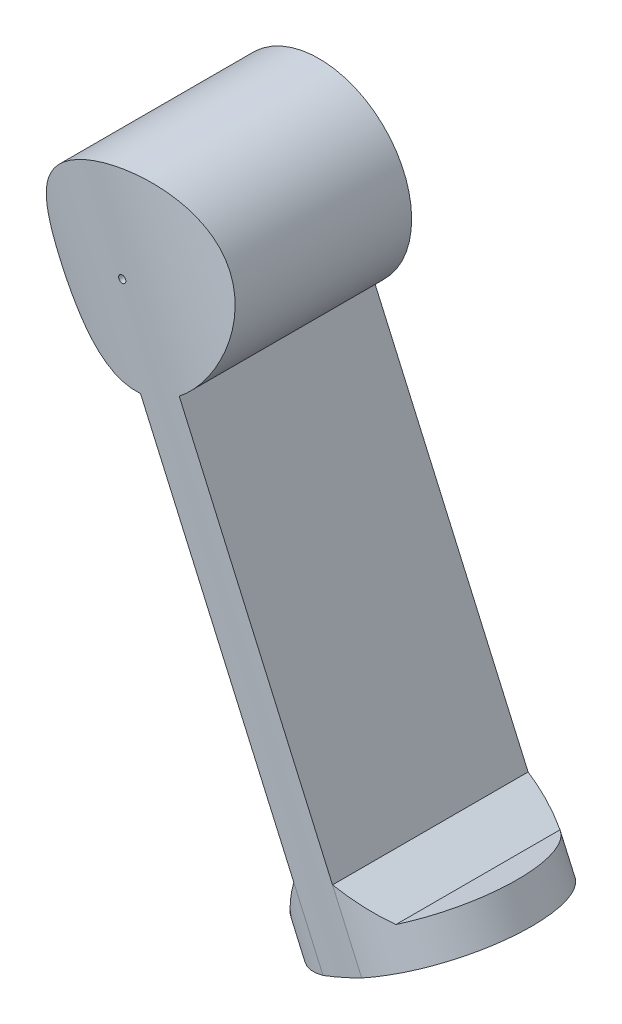
ISO-10303-21;
HEADER;
FILE_DESCRIPTION(('STEP AP214'),'2;1');
FILE_NAME('part.step','',(''),(''),'','','');
FILE_SCHEMA(('AUTOMOTIVE_DESIGN { 1 0 10303 214 1 1 1 1 }'));
ENDSEC;
DATA;
#1=APPLICATION_CONTEXT('core data for automotive mechanical design processes');
#2=APPLICATION_PROTOCOL_DEFINITION('international standard','automotive_design',2000,#1);
#3=PRODUCT_CONTEXT('',#1,'mechanical');
#4=PRODUCT('Part','Part','',(#3));
#5=PRODUCT_RELATED_PRODUCT_CATEGORY('part','',(#4));
#6=PRODUCT_DEFINITION_FORMATION('','',#4);
#7=PRODUCT_DEFINITION_CONTEXT('part definition',#1,'design');
#8=PRODUCT_DEFINITION('design','',#6,#7);
#9=PRODUCT_DEFINITION_SHAPE('','',#8);
#10=(LENGTH_UNIT() NAMED_UNIT(*) SI_UNIT(.MILLI.,.METRE.));
#11=(NAMED_UNIT(*) PLANE_ANGLE_UNIT() SI_UNIT($,.RADIAN.));
#12=(NAMED_UNIT(*) SI_UNIT($,.STERADIAN.) SOLID_ANGLE_UNIT());
#13=UNCERTAINTY_MEASURE_WITH_UNIT(LENGTH_MEASURE(1.E-05),#10,'distance_accuracy_value','');
#14=(GEOMETRIC_REPRESENTATION_CONTEXT(3) GLOBAL_UNCERTAINTY_ASSIGNED_CONTEXT((#13)) GLOBAL_UNIT_ASSIGNED_CONTEXT((#10,
#11,#12)) REPRESENTATION_CONTEXT('',''));
#15=CARTESIAN_POINT('',(0.,0.,0.));
#16=DIRECTION('',(0.,0.,1.));
#17=DIRECTION('',(1.,0.,0.));
#18=AXIS2_PLACEMENT_3D('',#15,#16,#17);
#19=CARTESIAN_POINT('',(55.304632903635,-224.555628784848,54.1865984850081));
#20=DIRECTION('',(0.914562167261489,0.40444535133188,0.));
#21=DIRECTION('',(-0.40444535133188,0.914562167261489,0.));
#22=AXIS2_PLACEMENT_3D('',#19,#20,#21);
#23=PLANE('',#22);
#24=DIRECTION('',(-0.40444535133188,0.914562167261489,0.));
#25=VECTOR('',#24,1.);
#26=CARTESIAN_POINT('',(55.304632903635,-224.555628784848,0.));
#27=LINE('',#26,#25);
#28=CARTESIAN_POINT('',(47.2157258769974,-206.264385439618,0.));
#29=VERTEX_POINT('',#28);
#30=CARTESIAN_POINT('',(4.74896398715,-110.235357877162,0.));
#31=VERTEX_POINT('',#30);
#32=EDGE_CURVE('E236',#29,#31,#27,.T.);
#33=ORIENTED_EDGE('',*,*,#32,.F.);
#34=DIRECTION('',(0.,0.,1.));
#35=VECTOR('',#34,1.);
#36=CARTESIAN_POINT('',(47.2157258769974,-206.264385439618,54.1865984850081));
#37=LINE('',#36,#35);
#38=CARTESIAN_POINT('',(47.2157258769974,-206.264385439618,54.1865984850081));
#39=VERTEX_POINT('',#38);
#40=EDGE_CURVE('E265',#29,#39,#37,.T.);
#41=ORIENTED_EDGE('',*,*,#40,.T.);
#42=DIRECTION('',(-0.40444535133188,0.914562167261489,0.));
#43=VECTOR('',#42,1.);
#44=CARTESIAN_POINT('',(55.304632903635,-224.555628784848,54.1865984850081));
#45=LINE('',#44,#43);
#46=CARTESIAN_POINT('',(4.74896398715,-110.235357877162,54.1865984850081));
#47=VERTEX_POINT('',#46);
#48=EDGE_CURVE('E126',#39,#47,#45,.T.);
#49=ORIENTED_EDGE('',*,*,#48,.T.);
#50=DIRECTION('',(0.,0.,-1.));
#51=VECTOR('',#50,1.);
#52=CARTESIAN_POINT('',(4.74896398715,-110.235357877162,54.5010000000006));
#53=LINE('',#52,#51);
#54=EDGE_CURVE('E253',#47,#31,#53,.T.);
#55=ORIENTED_EDGE('',*,*,#54,.T.);
#56=EDGE_LOOP('',(#33,#41,#49,#55));
#57=FACE_BOUND('',#56,.T.);
#58=ADVANCED_FACE('F41',(#57),#23,.F.);
#59=CARTESIAN_POINT('',(66.0289724959302,-219.813021393602,0.));
#60=DIRECTION('',(-0.914562167261489,-0.40444535133188,0.));
#61=DIRECTION('',(0.40444535133188,-0.914562167261489,0.));
#62=AXIS2_PLACEMENT_3D('',#59,#60,#61);
#63=PLANE('',#62);
#64=DIRECTION('',(-0.40444535133188,0.914562167261489,0.));
#65=VECTOR('',#64,1.);
#66=CARTESIAN_POINT('',(66.0289724959302,-219.813021393602,54.186598485008));
#67=LINE('',#66,#65);
#68=CARTESIAN_POINT('',(57.9400654692926,-201.521778048372,54.186598485008));
#69=VERTEX_POINT('',#68);
#70=CARTESIAN_POINT('',(15.4733035794452,-105.492750485916,54.186598485008));
#71=VERTEX_POINT('',#70);
#72=EDGE_CURVE('E230',#69,#71,#67,.T.);
#73=ORIENTED_EDGE('',*,*,#72,.F.);
#74=DIRECTION('',(0.,0.,-1.));
#75=VECTOR('',#74,1.);
#76=CARTESIAN_POINT('',(57.9400654692926,-201.521778048372,0.));
#77=LINE('',#76,#75);
#78=CARTESIAN_POINT('',(57.9400654692926,-201.521778048372,0.));
#79=VERTEX_POINT('',#78);
#80=EDGE_CURVE('E247',#69,#79,#77,.T.);
#81=ORIENTED_EDGE('',*,*,#80,.T.);
#82=DIRECTION('',(-0.40444535133188,0.914562167261489,0.));
#83=VECTOR('',#82,1.);
#84=CARTESIAN_POINT('',(66.0289724959302,-219.813021393602,0.));
#85=LINE('',#84,#83);
#86=CARTESIAN_POINT('',(15.4733035794452,-105.492750485916,0.));
#87=VERTEX_POINT('',#86);
#88=EDGE_CURVE('E232',#79,#87,#85,.T.);
#89=ORIENTED_EDGE('',*,*,#88,.T.);
#90=DIRECTION('',(0.,0.,-1.));
#91=VECTOR('',#90,1.);
#92=CARTESIAN_POINT('',(15.4733035794452,-105.492750485916,54.5010000000006));
#93=LINE('',#92,#91);
#94=EDGE_CURVE('E244',#71,#87,#93,.T.);
#95=ORIENTED_EDGE('',*,*,#94,.F.);
#96=EDGE_LOOP('',(#73,#81,#89,#95));
#97=FACE_BOUND('',#96,.T.);
#98=ADVANCED_FACE('F169',(#97),#63,.F.);
#99=CARTESIAN_POINT('',(0.,-85.,54.5010000000006));
#100=DIRECTION('',(0.,0.,-1.));
#101=DIRECTION('',(-1.,0.,0.));
#102=AXIS2_PLACEMENT_3D('',#99,#100,#101);
#103=CYLINDRICAL_SURFACE('',#102,25.6783166531544);
#104=ORIENTED_EDGE('',*,*,#54,.F.);
#105=CARTESIAN_POINT('',(4.74896398715001,-110.235357877162,54.1865984850081));
#106=CARTESIAN_POINT('',(4.39578173439005,-110.301823151769,54.1490899203728));
#107=CARTESIAN_POINT('',(4.04158383911201,-110.360799290803,54.1084011387251));
#108=CARTESIAN_POINT('',(3.33178426797788,-110.463773774932,54.020965873823));
#109=CARTESIAN_POINT('',(2.97618268605514,-110.507773105631,53.9742197894713));
#110=CARTESIAN_POINT('',(1.90870765732477,-110.61726038661,53.8254201912133));
#111=CARTESIAN_POINT('',(1.19560242375043,-110.660342901958,53.714744944893));
#112=CARTESIAN_POINT('',(-0.225566025707288,-110.687128495577,53.4738964361607));
#113=CARTESIAN_POINT('',(-0.93363813781695,-110.671049855118,53.3437965450759));
#114=CARTESIAN_POINT('',(-2.3429304154645,-110.580953843067,53.0671527324364));
#115=CARTESIAN_POINT('',(-3.04414968527553,-110.506928997293,52.9206066916671));
#116=CARTESIAN_POINT('',(-4.43403271839796,-110.302327779412,52.6150773286723));
#117=CARTESIAN_POINT('',(-5.12271836769118,-110.171862364575,52.456118908012));
#118=CARTESIAN_POINT('',(-6.48511084718551,-109.855750865252,52.1294260192904));
#119=CARTESIAN_POINT('',(-7.15881812306708,-109.670106424982,51.9616918128513));
#120=CARTESIAN_POINT('',(-8.48867717961974,-109.244714189853,51.6212924368115));
#121=CARTESIAN_POINT('',(-9.14480671891683,-109.004901165802,51.4486215432946));
#122=CARTESIAN_POINT('',(-10.1124764556144,-108.605837548371,51.1893136904957));
#123=CARTESIAN_POINT('',(-10.43229512978,-108.46625071921,51.102822984955));
#124=CARTESIAN_POINT('',(-11.0661621038571,-108.174076478821,50.9302476898909));
#125=CARTESIAN_POINT('',(-11.3802087930071,-108.021485503594,50.8441632185691));
#126=CARTESIAN_POINT('',(-12.3480503440152,-107.526559620502,50.5777135143377));
#127=CARTESIAN_POINT('',(-12.9911033562038,-107.16200221239,50.3990120031298));
#128=CARTESIAN_POINT('',(-14.2452393572118,-106.377467469278,50.0512869091966));
#129=CARTESIAN_POINT('',(-14.8563235253713,-105.957492180676,49.8822629694411));
#130=CARTESIAN_POINT('',(-15.7456880909242,-105.287608288772,49.6400466414462));
#131=CARTESIAN_POINT('',(-16.0376083117689,-105.057652100287,49.5611921004779));
#132=CARTESIAN_POINT('',(-16.6118007634477,-104.584747821933,49.4079205936118));
#133=CARTESIAN_POINT('',(-16.8940753965172,-104.341803006115,49.3335025193222));
#134=CARTESIAN_POINT('',(-17.7257219224704,-103.593827879944,49.1178577394246));
#135=CARTESIAN_POINT('',(-18.2600225846682,-103.069577032655,48.9842112057091));
#136=CARTESIAN_POINT('',(-19.2681217742951,-101.989553760178,48.7458332513059));
#137=CARTESIAN_POINT('',(-19.7432454166337,-101.435178879621,48.6403613025526));
#138=CARTESIAN_POINT('',(-20.6465273326701,-100.285004629084,48.4572549153725));
#139=CARTESIAN_POINT('',(-21.0746864776025,-99.6892060278869,48.3796199604831));
#140=CARTESIAN_POINT('',(-21.8793662443768,-98.4613381885927,48.255419492238));
#141=CARTESIAN_POINT('',(-22.2559304314486,-97.829300197695,48.2088276369896));
#142=CARTESIAN_POINT('',(-22.9539435822682,-96.5340139499445,48.1486115329208));
#143=CARTESIAN_POINT('',(-23.2753982925211,-95.8707689563847,48.1349838448379));
#144=CARTESIAN_POINT('',(-23.8284672296942,-94.5922686664522,48.1409280528063));
#145=CARTESIAN_POINT('',(-24.0660333434858,-93.9795598714024,48.1570754763182));
#146=CARTESIAN_POINT('',(-24.4931767525723,-92.7388999684583,48.2154779269083));
#147=CARTESIAN_POINT('',(-24.6827579178532,-92.1109500942364,48.2577308476319));
#148=CARTESIAN_POINT('',(-25.0129553117176,-90.8443527269605,48.3669147451412));
#149=CARTESIAN_POINT('',(-25.1535645092675,-90.2057037115874,48.4338492626905));
#150=CARTESIAN_POINT('',(-25.3853757515799,-88.9222370130245,48.5902130667698));
#151=CARTESIAN_POINT('',(-25.4765761466251,-88.2774191245929,48.6796431042597));
#152=CARTESIAN_POINT('',(-25.6092275166748,-86.9898823697911,48.8776144183032));
#153=CARTESIAN_POINT('',(-25.6509906358644,-86.3471761643727,48.986030768782));
#154=CARTESIAN_POINT('',(-25.6862654326647,-85.063470464654,49.2192794498823));
#155=CARTESIAN_POINT('',(-25.6797779188332,-84.4224709419342,49.3441115053839));
#156=CARTESIAN_POINT('',(-25.6192321022652,-83.14537868749,49.606921237428));
#157=CARTESIAN_POINT('',(-25.5651678014694,-82.5092865846498,49.7449005695067));
#158=CARTESIAN_POINT('',(-25.4102470967629,-81.2448459338262,50.030655249246));
#159=CARTESIAN_POINT('',(-25.3093737929778,-80.6165002667889,50.1784341183916));
#160=CARTESIAN_POINT('',(-25.048741063299,-79.3053824385909,50.4961282951682));
#161=CARTESIAN_POINT('',(-24.8839318504555,-78.6237798244404,50.6667435988213));
#162=CARTESIAN_POINT('',(-24.4994375419398,-77.2770495608926,51.0112237231812));
#163=CARTESIAN_POINT('',(-24.2797485662502,-76.6119230800194,51.1850887728417));
#164=CARTESIAN_POINT('',(-23.7865213356231,-75.3011346013338,51.5317712458763));
#165=CARTESIAN_POINT('',(-23.512948716837,-74.6554853295456,51.7045879277847));
#166=CARTESIAN_POINT('',(-22.9133945512714,-73.3877745809034,52.0447262208092));
#167=CARTESIAN_POINT('',(-22.5874309265868,-72.7657051273969,52.2120496875752));
#168=CARTESIAN_POINT('',(-21.8634299579862,-71.5121935374794,52.5468520524263));
#169=CARTESIAN_POINT('',(-21.4622550713892,-70.8824021361556,52.7137459593525));
#170=CARTESIAN_POINT('',(-20.6044712892669,-69.6575517359962,53.0321711346233));
#171=CARTESIAN_POINT('',(-20.147859560933,-69.0624945143712,53.1837016171743));
#172=CARTESIAN_POINT('',(-19.1818996008161,-67.9121541760709,53.4669933756228));
#173=CARTESIAN_POINT('',(-18.6725737802747,-67.3568543251595,53.5987629949153));
#174=CARTESIAN_POINT('',(-17.604223784886,-66.2907352595789,53.8386885970215));
#175=CARTESIAN_POINT('',(-17.0452040024153,-65.7799121215629,53.946846663911));
#176=CARTESIAN_POINT('',(-15.9166162822323,-64.837042320187,54.1305070113692));
#177=CARTESIAN_POINT('',(-15.3497218347709,-64.4021017816966,54.2075863674115));
#178=CARTESIAN_POINT('',(-14.179630705149,-63.5797935116597,54.3357923256212));
#179=CARTESIAN_POINT('',(-13.5764353316619,-63.1924240666713,54.3869198627435));
#180=CARTESIAN_POINT('',(-12.338742493948,-62.4690222472698,54.4617223035217));
#181=CARTESIAN_POINT('',(-11.7042592840308,-62.1329667756123,54.4854095902877));
#182=CARTESIAN_POINT('',(-10.4090353448979,-61.5150539222967,54.5046720403544));
#183=CARTESIAN_POINT('',(-9.74829606048685,-61.23319356339,54.5002487483853));
#184=CARTESIAN_POINT('',(-8.45866910541556,-60.7458389372598,54.4648714915411));
#185=CARTESIAN_POINT('',(-7.83132131097304,-60.5361009704125,54.4360154974986));
#186=CARTESIAN_POINT('',(-6.56373073325066,-60.1659653892395,54.3552611950881));
#187=CARTESIAN_POINT('',(-5.92348875539764,-60.0055647032146,54.3033643217184));
#188=CARTESIAN_POINT('',(-4.63462599515305,-59.7348093778529,54.1777987571927));
#189=CARTESIAN_POINT('',(-3.98600502355651,-59.6244558706637,54.1041295735745));
#190=CARTESIAN_POINT('',(-2.68476446427868,-59.4539905493317,53.9367781225654));
#191=CARTESIAN_POINT('',(-2.03214474949216,-59.3938803406705,53.8430952157732));
#192=CARTESIAN_POINT('',(-0.719636682442021,-59.3232615184794,53.6367180940995));
#193=CARTESIAN_POINT('',(-0.0597499458452307,-59.3133239141854,53.5238200740665));
#194=CARTESIAN_POINT('',(1.25593298293786,-59.3439752345688,53.2823531466499));
#195=CARTESIAN_POINT('',(1.91172918242726,-59.3845640690121,53.1537842672528));
#196=CARTESIAN_POINT('',(3.21582905910001,-59.5154170356868,52.8837839848659));
#197=CARTESIAN_POINT('',(3.86413070992379,-59.6056942960098,52.7423491908423));
#198=CARTESIAN_POINT('',(5.1498286569739,-59.8349117094364,52.4496925798431));
#199=CARTESIAN_POINT('',(5.7872243896949,-59.9738543691495,52.2984702590683));
#200=CARTESIAN_POINT('',(7.10121398171629,-60.3130191849804,51.97643334677));
#201=CARTESIAN_POINT('',(7.77659150168804,-60.5174148618241,51.8050410182543));
#202=CARTESIAN_POINT('',(9.107480387865,-60.9807099064552,51.4587794289657));
#203=CARTESIAN_POINT('',(9.76299072834839,-61.2396120828914,51.2839099894423));
#204=CARTESIAN_POINT('',(11.0509720376729,-61.8105983693308,50.9350494912213));
#205=CARTESIAN_POINT('',(11.683434806523,-62.1227011873937,50.7610587637606));
#206=CARTESIAN_POINT('',(12.921989349053,-62.7987353171418,50.418485801765));
#207=CARTESIAN_POINT('',(13.528068137562,-63.1626917809549,50.2499062408803));
#208=CARTESIAN_POINT('',(14.7415996403364,-63.9615448361664,49.9141634244423));
#209=CARTESIAN_POINT('',(15.3474017199209,-64.3991896233782,49.7475552060454));
#210=CARTESIAN_POINT('',(16.5208901707679,-65.3277951340597,49.431148791468));
#211=CARTESIAN_POINT('',(17.0885963421064,-65.8187278087308,49.2813418353417));
#212=CARTESIAN_POINT('',(18.1814092829781,-66.8512509226799,49.0038284855232));
#213=CARTESIAN_POINT('',(18.7065336694338,-67.3928202108647,48.8761129271477));
#214=CARTESIAN_POINT('',(19.7095467515141,-68.5233339132369,48.6476742779805));
#215=CARTESIAN_POINT('',(20.187440789964,-69.1122729551262,48.5469481318621));
#216=CARTESIAN_POINT('',(21.059027276851,-70.2897605375222,48.3827418734715));
#217=CARTESIAN_POINT('',(21.4562884862453,-70.8753704455234,48.3171257380835));
#218=CARTESIAN_POINT('',(22.2020823003157,-72.0792890161707,48.2153471131655));
#219=CARTESIAN_POINT('',(22.5506172846372,-72.6975960799499,48.1791831848599));
#220=CARTESIAN_POINT('',(23.1954729864237,-73.9614739991091,48.1377726193302));
#221=CARTESIAN_POINT('',(23.4918196071001,-74.6070311307958,48.1325106020371));
#222=CARTESIAN_POINT('',(24.0298442335846,-75.9200325118059,48.1530808525528));
#223=CARTESIAN_POINT('',(24.2715252278467,-76.5874755623873,48.1789114201076));
#224=CARTESIAN_POINT('',(24.6786815954424,-77.8759456524695,48.2568294020951));
#225=CARTESIAN_POINT('',(24.8491318745546,-78.4955705606226,48.306273175407));
#226=CARTESIAN_POINT('',(25.1427395529145,-79.7436226752341,48.4282878336723));
#227=CARTESIAN_POINT('',(25.2659004328388,-80.3720492303281,48.5008570157894));
#228=CARTESIAN_POINT('',(25.464720865434,-81.6337123893719,48.6669014788506));
#229=CARTESIAN_POINT('',(25.5403719843898,-82.2669498271465,48.7603804676158));
#230=CARTESIAN_POINT('',(25.6443400634858,-83.5343554779999,48.9655267859813));
#231=CARTESIAN_POINT('',(25.6726544913474,-84.1685237390568,49.0771950882691));
#232=CARTESIAN_POINT('',(25.6826436614739,-85.4602515879519,49.3205789848215));
#233=CARTESIAN_POINT('',(25.6623623061366,-86.1177063570751,49.4529279741707));
#234=CARTESIAN_POINT('',(25.5718171234662,-87.4266755157081,49.7305076944017));
#235=CARTESIAN_POINT('',(25.5015319389293,-88.07818724641,49.8757439063546));
#236=CARTESIAN_POINT('',(25.3118204242347,-89.3721151782812,50.1754254675904));
#237=CARTESIAN_POINT('',(25.1923759598794,-90.0145279324052,50.3298741972506));
#238=CARTESIAN_POINT('',(24.9052920786795,-91.2871286574893,50.6442588641745));
#239=CARTESIAN_POINT('',(24.7376486735798,-91.9173156122091,50.8041952545537));
#240=CARTESIAN_POINT('',(24.3343447077376,-93.2302316994999,51.1433874967513));
#241=CARTESIAN_POINT('',(24.0932852621453,-93.9112626733854,51.3228603022239));
#242=CARTESIAN_POINT('',(23.6892237997042,-94.9159979819611,51.5901465268569));
#243=CARTESIAN_POINT('',(23.5474457119766,-95.2481321550759,51.6789280196293));
#244=CARTESIAN_POINT('',(23.2498335400961,-95.9064994695547,51.8553158233423));
#245=CARTESIAN_POINT('',(23.0939949307192,-96.2327306702653,51.9429217454428));
#246=CARTESIAN_POINT('',(22.606045015023,-97.2010106725135,52.2028863319794));
#247=CARTESIAN_POINT('',(22.2531731176777,-97.8334579900168,52.3726100388785));
#248=CARTESIAN_POINT('',(21.4938118985484,-99.0683093599409,52.7004726567814));
#249=CARTESIAN_POINT('',(21.0873298537401,-99.6707174745799,52.8586131355551));
#250=CARTESIAN_POINT('',(20.2921872831349,-100.747254624301,53.1349882264039));
#251=CARTESIAN_POINT('',(19.9111651198333,-101.226438277303,53.2555513212084));
#252=CARTESIAN_POINT('',(19.1141907776784,-102.158069831212,53.4832647890821));
#253=CARTESIAN_POINT('',(18.6982455117091,-102.610522993245,53.590417806211));
#254=CARTESIAN_POINT('',(17.8323011952579,-103.486886089498,53.7893907243816));
#255=CARTESIAN_POINT('',(17.3822459419138,-103.91074664082,53.8811844833542));
#256=CARTESIAN_POINT('',(16.6837036233137,-104.522446719003,54.0058021556141));
#257=CARTESIAN_POINT('',(16.4468672895999,-104.722391321234,54.0451729826203));
#258=CARTESIAN_POINT('',(15.9656641469493,-105.113918628766,54.1193544634347));
#259=CARTESIAN_POINT('',(15.721296878479,-105.305500822067,54.1541648382833));
#260=CARTESIAN_POINT('',(15.4733035794452,-105.492750485916,54.186598485008));
#261=B_SPLINE_CURVE_WITH_KNOTS('',3,(#105,#106,#107,#108,#109,#110,#111,#112,#113,#114,#115,
#116,#117,#118,#119,#120,#121,#122,#123,#124,#125,#126,#127,#128,#129,#130,#131,#132,#133,#134,
#135,#136,#137,#138,#139,#140,#141,#142,#143,#144,#145,#146,#147,#148,#149,#150,#151,#152,#153,
#154,#155,#156,#157,#158,#159,#160,#161,#162,#163,#164,#165,#166,#167,#168,#169,#170,#171,#172,
#173,#174,#175,#176,#177,#178,#179,#180,#181,#182,#183,#184,#185,#186,#187,#188,#189,#190,#191,
#192,#193,#194,#195,#196,#197,#198,#199,#200,#201,#202,#203,#204,#205,#206,#207,#208,#209,#210,
#211,#212,#213,#214,#215,#216,#217,#218,#219,#220,#221,#222,#223,#224,#225,#226,#227,#228,#229,
#230,#231,#232,#233,#234,#235,#236,#237,#238,#239,#240,#241,#242,#243,#244,#245,#246,#247,#248,
#249,#250,#251,#252,#253,#254,#255,#256,#257,#258,#259,#260),.UNSPECIFIED.,.F.,.F.,(4,2,2,2,2,2,
2,2,2,2,2,2,2,2,2,2,2,2,2,2,2,2,2,2,2,2,2,2,2,2,2,2,2,2,2,2,2,2,2,2,2,2,2,2,2,2,2,2,2,2,2,2,2,2,
2,2,2,2,2,2,2,2,2,2,2,2,2,2,2,2,2,2,2,2,2,2,2,4),(0.,1.08380414968053,2.16753696184339,
4.33328538717988,6.49105108343726,8.6490951445765,10.8029158212141,12.9566723250656,
15.1130363167575,16.1913303903954,17.2699209445759,19.5485331471293,21.8270612316583,
22.9663988072325,24.1054505312447,26.3831473831034,28.593235997772,30.8032836063234,
33.0114534631566,35.2193929242702,37.1890302970783,39.1585087679817,41.1282698856129,
43.0980967678178,45.0554187844598,47.0127080014372,48.97024401143,50.9284873187476,
53.0912504614518,55.2541665555224,57.4184665240178,59.5820276909949,61.8745256387957,
64.1671407820108,66.4587851995925,68.7502272631015,70.9033546453134,73.0564044522375,
75.208482261756,77.3604418114807,79.3444167283428,81.3282680995211,83.3121643463658,
85.2961239844957,87.302612759235,89.3090979506332,91.3161135266133,93.3232324931853,
95.4992894521327,97.6754585679158,99.8523945204557,102.030390035464,104.324543703044,
106.617495614606,108.909493994746,111.201232800315,113.330326543993,115.459316272649,
117.587246300307,119.715059970406,121.64647122243,123.577740288095,125.50935208696,
127.441067214183,129.451835647973,131.463463419804,133.475833920139,135.488370983426,
137.718795870128,138.834175514731,139.949915421282,142.17869732166,144.407177000677,
146.277439490672,148.14733263881,150.020376740011,150.957494527111,151.894669610285),.UNSPECIFIED.);
#262=EDGE_CURVE('E148',#47,#71,#261,.T.);
#263=ORIENTED_EDGE('',*,*,#262,.T.);
#264=ORIENTED_EDGE('',*,*,#94,.T.);
#265=CARTESIAN_POINT('',(0.,-85.,0.));
#266=DIRECTION('',(0.,0.,1.));
#267=DIRECTION('',(1.,0.,0.));
#268=AXIS2_PLACEMENT_3D('',#265,#266,#267);
#269=CIRCLE('',#268,25.6783166531544);
#270=EDGE_CURVE('E147',#87,#31,#269,.T.);
#271=ORIENTED_EDGE('',*,*,#270,.T.);
#272=EDGE_LOOP('',(#104,#263,#264,#271));
#273=FACE_BOUND('',#272,.T.);
#274=ADVANCED_FACE('F165',(#273),#103,.T.);
#275=CARTESIAN_POINT('',(0.,-85.,0.));
#276=DIRECTION('',(0.,0.,1.));
#277=DIRECTION('',(1.,0.,0.));
#278=AXIS2_PLACEMENT_3D('',#275,#276,#277);
#279=PLANE('',#278);
#280=CARTESIAN_POINT('',(55.304632903635,-224.555628784848,0.));
#281=VERTEX_POINT('',#280);
#282=EDGE_CURVE('E108',#281,#29,#27,.T.);
#283=ORIENTED_EDGE('',*,*,#282,.T.);
#284=ORIENTED_EDGE('',*,*,#32,.T.);
#285=ORIENTED_EDGE('',*,*,#270,.F.);
#286=ORIENTED_EDGE('',*,*,#88,.F.);
#287=CARTESIAN_POINT('',(66.0289724959302,-219.813021393602,0.));
#288=VERTEX_POINT('',#287);
#289=EDGE_CURVE('E233',#288,#79,#85,.T.);
#290=ORIENTED_EDGE('',*,*,#289,.F.);
#291=DIRECTION('',(0.914562167261489,0.40444535133188,0.));
#292=VECTOR('',#291,1.);
#293=CARTESIAN_POINT('',(55.304632903635,-224.555628784848,0.));
#294=LINE('',#293,#292);
#295=EDGE_CURVE('E119',#281,#288,#294,.T.);
#296=ORIENTED_EDGE('',*,*,#295,.F.);
#297=EDGE_LOOP('',(#283,#284,#285,#286,#290,#296));
#298=FACE_BOUND('',#297,.T.);
#299=CARTESIAN_POINT('',(0.,-85.,0.));
#300=DIRECTION('',(0.,0.,-1.));
#301=DIRECTION('',(-1.,0.,0.));
#302=AXIS2_PLACEMENT_3D('',#299,#300,#301);
#303=CIRCLE('',#302,1.);
#304=CARTESIAN_POINT('',(-1.,-85.,0.));
#305=VERTEX_POINT('',#304);
#306=EDGE_CURVE('E129',#305,#305,#303,.T.);
#307=ORIENTED_EDGE('',*,*,#306,.F.);
#308=EDGE_LOOP('',(#307));
#309=FACE_BOUND('',#308,.T.);
#310=ADVANCED_FACE('F163',(#298,#309),#279,.F.);
#311=CARTESIAN_POINT('',(-28.3111745932314,-20.9806482916973,-0.499999999999453));
#312=DIRECTION('',(-0.404445351331881,0.914562167261489,0.));
#313=DIRECTION('',(-0.914562167261489,-0.404445351331881,0.));
#314=AXIS2_PLACEMENT_3D('',#311,#312,#313);
#315=CYLINDRICAL_SURFACE('',#314,55.);
#316=CARTESIAN_POINT('',(66.0289724959302,-219.813021393602,54.186598485008));
#317=VERTEX_POINT('',#316);
#318=EDGE_CURVE('E58',#317,#69,#67,.T.);
#319=ORIENTED_EDGE('',*,*,#318,.T.);
#320=ORIENTED_EDGE('',*,*,#72,.T.);
#321=ORIENTED_EDGE('',*,*,#262,.F.);
#322=ORIENTED_EDGE('',*,*,#48,.F.);
#323=CARTESIAN_POINT('',(55.304632903635,-224.555628784848,54.1865984850081));
#324=VERTEX_POINT('',#323);
#325=EDGE_CURVE('E105',#324,#39,#45,.T.);
#326=ORIENTED_EDGE('',*,*,#325,.F.);
#327=CARTESIAN_POINT('',(60.6668026997823,-222.184325089225,-0.499999999999327));
#328=DIRECTION('',(0.40444535133188,-0.914562167261489,0.));
#329=DIRECTION('',(0.914562167261489,0.40444535133188,0.));
#330=AXIS2_PLACEMENT_3D('',#327,#328,#329);
#331=CIRCLE('',#330,55.);
#332=EDGE_CURVE('E116',#317,#324,#331,.T.);
#333=ORIENTED_EDGE('',*,*,#332,.F.);
#334=EDGE_LOOP('',(#319,#320,#321,#322,#326,#333));
#335=FACE_BOUND('',#334,.T.);
#336=CARTESIAN_POINT('',(-1.,-85.,54.4923956201427));
#337=CARTESIAN_POINT('',(-0.999997513539082,-85.056162437725,54.4920179592549));
#338=CARTESIAN_POINT('',(-0.995252814187239,-85.1123658411768,54.4916983792427));
#339=CARTESIAN_POINT('',(-0.976390752173137,-85.2232256662963,54.491212079589));
#340=CARTESIAN_POINT('',(-0.96226215954066,-85.2778801525201,54.4910455436695));
#341=CARTESIAN_POINT('',(-0.925034233466295,-85.3840203891035,54.4908845678804));
#342=CARTESIAN_POINT('',(-0.901939141757089,-85.4355076244552,54.4908900467342));
#343=CARTESIAN_POINT('',(-0.847439733160817,-85.5338599796703,54.4910723276755));
#344=CARTESIAN_POINT('',(-0.816037472643445,-85.5807262394813,54.4912490873926));
#345=CARTESIAN_POINT('',(-0.745810163733773,-85.6685263213466,54.4917539383319));
#346=CARTESIAN_POINT('',(-0.706984578389002,-85.7094597138811,54.4920820405037));
#347=CARTESIAN_POINT('',(-0.623012465653904,-85.7842296322839,54.4928526099204));
#348=CARTESIAN_POINT('',(-0.577865686108959,-85.8180658749097,54.4932950817281));
#349=CARTESIAN_POINT('',(-0.48252853473798,-85.8776829556739,54.4942445557246));
#350=CARTESIAN_POINT('',(-0.432337634895792,-85.9034629493247,54.4947515646706));
#351=CARTESIAN_POINT('',(-0.328340483870593,-85.946231295579,54.4957729234566));
#352=CARTESIAN_POINT('',(-0.274534237300096,-85.9632196593987,54.4962872732872));
#353=CARTESIAN_POINT('',(-0.164827014691301,-85.9879240283609,54.4972653930261));
#354=CARTESIAN_POINT('',(-0.10892581272561,-85.9956390304469,54.497729157458));
#355=CARTESIAN_POINT('',(0.00337904140585012,-86.0015739975159,54.4985537564623));
#356=CARTESIAN_POINT('',(0.0597826923998799,-85.9997939846361,54.4989145912747));
#357=CARTESIAN_POINT('',(0.17148695361988,-85.9867896030462,54.4994926264161));
#358=CARTESIAN_POINT('',(0.226787647631675,-85.9755659545382,54.4997098376959));
#359=CARTESIAN_POINT('',(0.334720239976415,-85.9439936022753,54.4999761801965));
#360=CARTESIAN_POINT('',(0.387352138046728,-85.9236448976223,54.5000253114008));
#361=CARTESIAN_POINT('',(0.488445408828583,-85.874403671507,54.4999499596074));
#362=CARTESIAN_POINT('',(0.536907365213963,-85.8455123482892,54.4998255009496));
#363=CARTESIAN_POINT('',(0.628293413339798,-85.7800051525879,54.499417042184));
#364=CARTESIAN_POINT('',(0.671217506664314,-85.743389282314,54.4991330421219));
#365=CARTESIAN_POINT('',(0.750310404702162,-85.6634719038756,54.4984375044871));
#366=CARTESIAN_POINT('',(0.786479105937865,-85.6201702933189,54.4980259649609));
#367=CARTESIAN_POINT('',(0.851034426328738,-85.5281107836147,54.4971217298239));
#368=CARTESIAN_POINT('',(0.879421036661107,-85.4793528782812,54.496629034121));
#369=CARTESIAN_POINT('',(0.927610544212011,-85.3777567213583,54.495617935607));
#370=CARTESIAN_POINT('',(0.947412183263624,-85.324917873024,54.4950995290402));
#371=CARTESIAN_POINT('',(0.977863768449265,-85.2166654629051,54.4940955149038));
#372=CARTESIAN_POINT('',(0.988513712020953,-85.1612519003997,54.4936099073435));
#373=CARTESIAN_POINT('',(1.00035969337215,-85.049419828428,54.4927262195537));
#374=CARTESIAN_POINT('',(1.001555265735,-84.993001269625,54.4923281436342));
#375=CARTESIAN_POINT('',(0.99445692623826,-84.8807635154225,54.4916644455077));
#376=CARTESIAN_POINT('',(0.986163022140472,-84.8249443195326,54.4913988231924));
#377=CARTESIAN_POINT('',(0.960322520114141,-84.7154971598816,54.4910300184704));
#378=CARTESIAN_POINT('',(0.942777078218019,-84.6618689232494,54.4909268157748));
#379=CARTESIAN_POINT('',(0.898932222518392,-84.5583190150453,54.49089442706));
#380=CARTESIAN_POINT('',(0.872632816005165,-84.5083973403867,54.4909652408959));
#381=CARTESIAN_POINT('',(0.812030033869527,-84.4136828656188,54.4912728812194));
#382=CARTESIAN_POINT('',(0.777727492850325,-84.3688895314285,54.4915096904014));
#383=CARTESIAN_POINT('',(0.702090796782061,-84.285696840846,54.4921226004907));
#384=CARTESIAN_POINT('',(0.66075663500412,-84.2472974905726,54.4924987015312));
#385=CARTESIAN_POINT('',(0.572226371392914,-84.1779793890166,54.493347829782));
#386=CARTESIAN_POINT('',(0.525029803191241,-84.1470612334585,54.4938208647056));
#387=CARTESIAN_POINT('',(0.426116681920355,-84.0935865096413,54.4948105183164));
#388=CARTESIAN_POINT('',(0.37440012933726,-84.0710299404829,54.495327136999));
#389=CARTESIAN_POINT('',(0.267906876057287,-84.0349157543609,54.4963458017138));
#390=CARTESIAN_POINT('',(0.213129752421789,-84.0213593844809,54.4968478457174));
#391=CARTESIAN_POINT('',(0.102076340790563,-84.0036355221581,54.4977806897391));
#392=CARTESIAN_POINT('',(0.0458000503045582,-83.9994680453122,54.4982114896389));
#393=CARTESIAN_POINT('',(-0.0666530869620074,-84.0006406699267,54.4989532689167));
#394=CARTESIAN_POINT('',(-0.122829935724421,-84.0059805797219,54.49926425071));
#395=CARTESIAN_POINT('',(-0.23349042128896,-84.0260164215056,54.4997313438032));
#396=CARTESIAN_POINT('',(-0.28797405641513,-84.0407123627544,54.4998874549499));
#397=CARTESIAN_POINT('',(-0.393693985254047,-84.0790406638364,54.5000271948295));
#398=CARTESIAN_POINT('',(-0.444930694795339,-84.1026718766322,54.5000108456943));
#399=CARTESIAN_POINT('',(-0.542707813335606,-84.158198980013,54.4998075647814));
#400=CARTESIAN_POINT('',(-0.589248407383436,-84.190094544767,54.4996206397282));
#401=CARTESIAN_POINT('',(-0.676307966519438,-84.2612392340956,54.4990973298985));
#402=CARTESIAN_POINT('',(-0.71682783695718,-84.3004872510547,54.4987609676236));
#403=CARTESIAN_POINT('',(-0.790714412858709,-84.3852386660537,54.4979765780498));
#404=CARTESIAN_POINT('',(-0.824079337646922,-84.4307436166639,54.4975285230135));
#405=CARTESIAN_POINT('',(-0.88271360454363,-84.5267316328581,54.4965710501562));
#406=CARTESIAN_POINT('',(-0.907978055703517,-84.5772176819931,54.4960615955174));
#407=CARTESIAN_POINT('',(-0.949644096533317,-84.6816750705715,54.4950394688706));
#408=CARTESIAN_POINT('',(-0.966056271775295,-84.7356421604899,54.4945268014501));
#409=CARTESIAN_POINT('',(-0.98519100777212,-84.824959454517,54.4937374199632));
#410=CARTESIAN_POINT('',(-0.990737409208946,-84.8597298919761,54.4934441270443));
#411=CARTESIAN_POINT('',(-0.998142684334199,-84.9296615291203,54.4928915008384));
#412=CARTESIAN_POINT('',(-1.00000155739162,-84.9648227288722,54.4926321675573));
#413=CARTESIAN_POINT('',(-1.,-85.,54.4923956201427));
#414=B_SPLINE_CURVE_WITH_KNOTS('',3,(#336,#337,#338,#339,#340,#341,#342,#343,#344,#345,#346,
#347,#348,#349,#350,#351,#352,#353,#354,#355,#356,#357,#358,#359,#360,#361,#362,#363,#364,#365,
#366,#367,#368,#369,#370,#371,#372,#373,#374,#375,#376,#377,#378,#379,#380,#381,#382,#383,#384,
#385,#386,#387,#388,#389,#390,#391,#392,#393,#394,#395,#396,#397,#398,#399,#400,#401,#402,#403,
#404,#405,#406,#407,#408,#409,#410,#411,#412,#413),.UNSPECIFIED.,.T.,.F.,(4,2,2,2,2,2,2,2,2,2,2,
2,2,2,2,2,2,2,2,2,2,2,2,2,2,2,2,2,2,2,2,2,2,2,2,2,2,2,4),(0.,0.168362756296444,
0.336927360975247,0.505412320691695,0.673855612338752,0.842311092632374,1.01077329458875,
1.1792531494943,1.34773278945482,1.51623065143809,1.68472812057761,1.8532127407228,
2.02169737744832,2.1901583925987,2.35861935956206,2.52708290676233,2.69554664495421,
2.86403506394074,3.0325235301015,3.20102029050499,3.36951691308869,3.53799248604597,
3.7064679186976,3.87492578981296,4.04338382213424,4.21185526428678,4.3803266883204,
4.54882145118549,4.71731649395586,4.88580813997032,5.05429995275382,5.22277014327014,
5.39123369268051,5.55967188416063,5.72815194689916,5.8967335447273,6.06511310282544,
6.17056688212187,6.27602067946339),.UNSPECIFIED.);
#415=CARTESIAN_POINT('',(-1.,-85.,54.4923956201427));
#416=VERTEX_POINT('',#415);
#417=EDGE_CURVE('E134',#416,#416,#414,.T.);
#418=ORIENTED_EDGE('',*,*,#417,.F.);
#419=EDGE_LOOP('',(#418));
#420=FACE_BOUND('',#419,.T.);
#421=ADVANCED_FACE('F123',(#335,#420),#315,.T.);
#422=CARTESIAN_POINT('',(0.,-85.,54.5020000000006));
#423=DIRECTION('',(0.,0.,-1.));
#424=DIRECTION('',(-1.,0.,0.));
#425=AXIS2_PLACEMENT_3D('',#422,#423,#424);
#426=CYLINDRICAL_SURFACE('',#425,1.);
#427=ORIENTED_EDGE('',*,*,#417,.T.);
#428=EDGE_LOOP('',(#427));
#429=FACE_BOUND('',#428,.T.);
#430=ORIENTED_EDGE('',*,*,#306,.T.);
#431=EDGE_LOOP('',(#430));
#432=FACE_BOUND('',#431,.T.);
#433=ADVANCED_FACE('F156',(#429,#432),#426,.F.);
#434=CARTESIAN_POINT('',(60.6668026997823,-222.184325089225,-0.499999999999327));
#435=DIRECTION('',(0.40444535133188,-0.914562167261489,0.));
#436=DIRECTION('',(0.914562167261489,0.40444535133188,0.));
#437=AXIS2_PLACEMENT_3D('',#434,#435,#436);
#438=PLANE('',#437);
#439=CARTESIAN_POINT('',(60.6668026997826,-222.184325089225,27.093299242504));
#440=DIRECTION('',(0.40444535133188,-0.914562167261489,0.));
#441=DIRECTION('',(0.914562167261489,0.40444535133188,0.));
#442=AXIS2_PLACEMENT_3D('',#439,#440,#441);
#443=CIRCLE('',#442,0.99999999999999);
#444=CARTESIAN_POINT('',(61.5813648670441,-221.779879737893,27.093299242504));
#445=VERTEX_POINT('',#444);
#446=EDGE_CURVE('E214',#445,#445,#443,.T.);
#447=ORIENTED_EDGE('',*,*,#446,.F.);
#448=EDGE_LOOP('',(#447));
#449=FACE_BOUND('',#448,.T.);
#450=ORIENTED_EDGE('',*,*,#332,.T.);
#451=CARTESIAN_POINT('',(60.6668026997826,-222.184325089225,27.093299242504));
#452=DIRECTION('',(0.40444535133188,-0.914562167261489,0.));
#453=DIRECTION('',(0.914562167261489,0.40444535133188,0.));
#454=AXIS2_PLACEMENT_3D('',#451,#452,#453);
#455=CIRCLE('',#454,27.7204402920203);
#456=EDGE_CURVE('E101',#324,#281,#455,.T.);
#457=ORIENTED_EDGE('',*,*,#456,.T.);
#458=ORIENTED_EDGE('',*,*,#295,.T.);
#459=CARTESIAN_POINT('',(60.6668026997826,-222.184325089225,27.093299242504));
#460=DIRECTION('',(0.40444535133188,-0.914562167261489,0.));
#461=DIRECTION('',(0.914562167261489,0.40444535133188,0.));
#462=AXIS2_PLACEMENT_3D('',#459,#460,#461);
#463=CIRCLE('',#462,27.7204402920203);
#464=EDGE_CURVE('E114',#288,#317,#463,.T.);
#465=ORIENTED_EDGE('',*,*,#464,.T.);
#466=EDGE_LOOP('',(#450,#457,#458,#465));
#467=FACE_BOUND('',#466,.T.);
#468=ADVANCED_FACE('F117',(#449,#467),#438,.T.);
#469=CARTESIAN_POINT('',(88.0630346359619,-199.134739828423,0.));
#470=DIRECTION('',(0.40444535133188,-0.914562167261489,0.));
#471=DIRECTION('',(0.914562167261489,0.40444535133188,0.));
#472=AXIS2_PLACEMENT_3D('',#469,#470,#471);
#473=PLANE('',#472);
#474=CARTESIAN_POINT('',(56.6223491864638,-213.03870341661,27.093299242504));
#475=DIRECTION('',(0.40444535133188,-0.914562167261489,0.));
#476=DIRECTION('',(0.914562167261489,0.40444535133188,0.));
#477=AXIS2_PLACEMENT_3D('',#474,#475,#476);
#478=CIRCLE('',#477,27.7204402920203);
#479=CARTESIAN_POINT('',(71.1301406552264,-206.622946207668,4.3603967415414));
#480=VERTEX_POINT('',#479);
#481=CARTESIAN_POINT('',(71.1301406552264,-206.622946207668,49.8262017434666));
#482=VERTEX_POINT('',#481);
#483=EDGE_CURVE('E113',#480,#482,#478,.T.);
#484=ORIENTED_EDGE('',*,*,#483,.F.);
#485=DIRECTION('',(0.,0.,1.));
#486=VECTOR('',#485,1.);
#487=CARTESIAN_POINT('',(71.1301406552264,-206.622946207668,54.186598485008));
#488=LINE('',#487,#486);
#489=EDGE_CURVE('E268',#480,#482,#488,.T.);
#490=ORIENTED_EDGE('',*,*,#489,.T.);
#491=EDGE_LOOP('',(#484,#490));
#492=FACE_BOUND('',#491,.T.);
#493=ADVANCED_FACE('F193',(#492),#473,.F.);
#494=CARTESIAN_POINT('',(56.6223491864638,-213.03870341661,27.093299242504));
#495=DIRECTION('',(0.40444535133188,-0.914562167261489,0.));
#496=DIRECTION('',(0.914562167261489,0.40444535133188,0.));
#497=AXIS2_PLACEMENT_3D('',#494,#495,#496);
#498=CYLINDRICAL_SURFACE('',#497,27.7204402920203);
#499=ORIENTED_EDGE('',*,*,#464,.F.);
#500=ORIENTED_EDGE('',*,*,#289,.T.);
#501=CARTESIAN_POINT('',(50.2065919775221,-198.530911947848,27.093299242504));
#502=DIRECTION('',(0.360707059741113,0.932679160833414,0.));
#503=DIRECTION('',(0.932679160833414,-0.360707059741113,0.));
#504=AXIS2_PLACEMENT_3D('',#501,#502,#503);
#505=ELLIPSE('',#504,39.2026226159285,27.7204402920203);
#506=EDGE_CURVE('E11',#79,#480,#505,.F.);
#507=ORIENTED_EDGE('',*,*,#506,.T.);
#508=ORIENTED_EDGE('',*,*,#483,.T.);
#509=CARTESIAN_POINT('',(50.2065919775221,-198.530911947848,27.093299242504));
#510=DIRECTION('',(0.360707059741113,0.932679160833414,0.));
#511=DIRECTION('',(0.932679160833414,-0.360707059741113,0.));
#512=AXIS2_PLACEMENT_3D('',#509,#510,#511);
#513=ELLIPSE('',#512,39.2026226159285,27.7204402920203);
#514=EDGE_CURVE('E51',#482,#69,#513,.F.);
#515=ORIENTED_EDGE('',*,*,#514,.T.);
#516=ORIENTED_EDGE('',*,*,#318,.F.);
#517=EDGE_LOOP('',(#499,#500,#507,#508,#515,#516));
#518=FACE_BOUND('',#517,.T.);
#519=ADVANCED_FACE('F195',(#518),#498,.T.);
#520=CARTESIAN_POINT('',(56.6223491864638,-213.03870341661,27.093299242504));
#521=DIRECTION('',(0.40444535133188,-0.914562167261489,0.));
#522=DIRECTION('',(0.914562167261489,0.40444535133188,0.));
#523=AXIS2_PLACEMENT_3D('',#520,#521,#522);
#524=CIRCLE('',#523,27.7204402920203);
#525=CARTESIAN_POINT('',(42.1145577177012,-219.454460625552,49.8262017434666));
#526=VERTEX_POINT('',#525);
#527=CARTESIAN_POINT('',(42.1145577177012,-219.454460625552,4.36039674154142));
#528=VERTEX_POINT('',#527);
#529=EDGE_CURVE('E120',#526,#528,#524,.T.);
#530=ORIENTED_EDGE('',*,*,#529,.F.);
#531=DIRECTION('',(0.,0.,-1.));
#532=VECTOR('',#531,1.);
#533=CARTESIAN_POINT('',(42.1145577177012,-219.454460625552,0.));
#534=LINE('',#533,#532);
#535=EDGE_CURVE('E261',#526,#528,#534,.T.);
#536=ORIENTED_EDGE('',*,*,#535,.T.);
#537=EDGE_LOOP('',(#530,#536));
#538=FACE_BOUND('',#537,.T.);
#539=ADVANCED_FACE('F180',(#538),#473,.F.);
#540=CARTESIAN_POINT('',(56.6223491864638,-213.03870341661,27.093299242504));
#541=DIRECTION('',(0.40444535133188,-0.914562167261489,0.));
#542=DIRECTION('',(0.914562167261489,0.40444535133188,0.));
#543=AXIS2_PLACEMENT_3D('',#540,#541,#542);
#544=CYLINDRICAL_SURFACE('',#543,27.7204402920203);
#545=ORIENTED_EDGE('',*,*,#456,.F.);
#546=ORIENTED_EDGE('',*,*,#325,.T.);
#547=CARTESIAN_POINT('',(50.2065919775221,-198.530911947848,27.093299242504));
#548=DIRECTION('',(-0.93267916083341,0.360707059741123,0.));
#549=DIRECTION('',(-0.360707059741123,-0.93267916083341,0.));
#550=AXIS2_PLACEMENT_3D('',#547,#548,#549);
#551=ELLIPSE('',#550,39.2026226159284,27.7204402920203);
#552=EDGE_CURVE('E277',#39,#526,#551,.F.);
#553=ORIENTED_EDGE('',*,*,#552,.T.);
#554=ORIENTED_EDGE('',*,*,#529,.T.);
#555=CARTESIAN_POINT('',(50.2065919775221,-198.530911947848,27.093299242504));
#556=DIRECTION('',(-0.93267916083341,0.360707059741123,0.));
#557=DIRECTION('',(-0.360707059741123,-0.93267916083341,0.));
#558=AXIS2_PLACEMENT_3D('',#555,#556,#557);
#559=ELLIPSE('',#558,39.2026226159284,27.7204402920203);
#560=EDGE_CURVE('E274',#528,#29,#559,.F.);
#561=ORIENTED_EDGE('',*,*,#560,.T.);
#562=ORIENTED_EDGE('',*,*,#282,.F.);
#563=EDGE_LOOP('',(#545,#546,#553,#554,#561,#562));
#564=FACE_BOUND('',#563,.T.);
#565=ADVANCED_FACE('F103',(#564),#544,.T.);
#566=CARTESIAN_POINT('',(42.1145577177013,-219.454460625552,0.));
#567=DIRECTION('',(-0.93267916083341,0.360707059741123,0.));
#568=DIRECTION('',(0.,0.,1.));
#569=AXIS2_PLACEMENT_3D('',#566,#567,#568);
#570=PLANE('',#569);
#571=ORIENTED_EDGE('',*,*,#552,.F.);
#572=ORIENTED_EDGE('',*,*,#40,.F.);
#573=ORIENTED_EDGE('',*,*,#560,.F.);
#574=ORIENTED_EDGE('',*,*,#535,.F.);
#575=EDGE_LOOP('',(#571,#572,#573,#574));
#576=FACE_BOUND('',#575,.T.);
#577=ADVANCED_FACE('F171',(#576),#570,.T.);
#578=CARTESIAN_POINT('',(71.1301406552264,-206.622946207668,0.));
#579=DIRECTION('',(0.360707059741113,0.932679160833414,0.));
#580=DIRECTION('',(0.,0.,-1.));
#581=AXIS2_PLACEMENT_3D('',#578,#579,#580);
#582=PLANE('',#581);
#583=ORIENTED_EDGE('',*,*,#506,.F.);
#584=ORIENTED_EDGE('',*,*,#80,.F.);
#585=ORIENTED_EDGE('',*,*,#514,.F.);
#586=ORIENTED_EDGE('',*,*,#489,.F.);
#587=EDGE_LOOP('',(#583,#584,#585,#586));
#588=FACE_BOUND('',#587,.T.);
#589=ADVANCED_FACE('F43',(#588),#582,.T.);
#590=CARTESIAN_POINT('',(56.6223491864638,-213.03870341661,27.093299242504));
#591=DIRECTION('',(0.40444535133188,-0.914562167261489,0.));
#592=DIRECTION('',(0.914562167261489,0.40444535133188,0.));
#593=AXIS2_PLACEMENT_3D('',#590,#591,#592);
#594=CYLINDRICAL_SURFACE('',#593,0.99999999999999);
#595=CARTESIAN_POINT('',(56.6223491864638,-213.03870341661,27.093299242504));
#596=DIRECTION('',(0.40444535133188,-0.914562167261489,0.));
#597=DIRECTION('',(0.914562167261489,0.40444535133188,0.));
#598=AXIS2_PLACEMENT_3D('',#595,#596,#597);
#599=CIRCLE('',#598,0.99999999999999);
#600=CARTESIAN_POINT('',(57.5369113537253,-212.634258065278,27.093299242504));
#601=VERTEX_POINT('',#600);
#602=EDGE_CURVE('E212',#601,#601,#599,.T.);
#603=ORIENTED_EDGE('',*,*,#602,.F.);
#604=EDGE_LOOP('',(#603));
#605=FACE_BOUND('',#604,.T.);
#606=ORIENTED_EDGE('',*,*,#446,.T.);
#607=EDGE_LOOP('',(#606));
#608=FACE_BOUND('',#607,.T.);
#609=ADVANCED_FACE('F178',(#605,#608),#594,.F.);
#610=CARTESIAN_POINT('',(56.6223491864638,-213.03870341661,27.093299242504));
#611=DIRECTION('',(0.40444535133188,-0.914562167261489,0.));
#612=DIRECTION('',(0.914562167261489,0.40444535133188,0.));
#613=AXIS2_PLACEMENT_3D('',#610,#611,#612);
#614=PLANE('',#613);
#615=ORIENTED_EDGE('',*,*,#602,.T.);
#616=EDGE_LOOP('',(#615));
#617=FACE_BOUND('',#616,.T.);
#618=ADVANCED_FACE('F204',(#617),#614,.T.);
#619=CLOSED_SHELL('',(#58,#98,#274,#310,#421,#433,#468,#493,#519,#539,#565,#577,#589,#609,#618));
#620=MANIFOLD_SOLID_BREP('B2',#619);
#621=ADVANCED_BREP_SHAPE_REPRESENTATION('',(#18,#620),#14);
#622=SHAPE_DEFINITION_REPRESENTATION(#9,#621);
ENDSEC;
END-ISO-10303-21;
